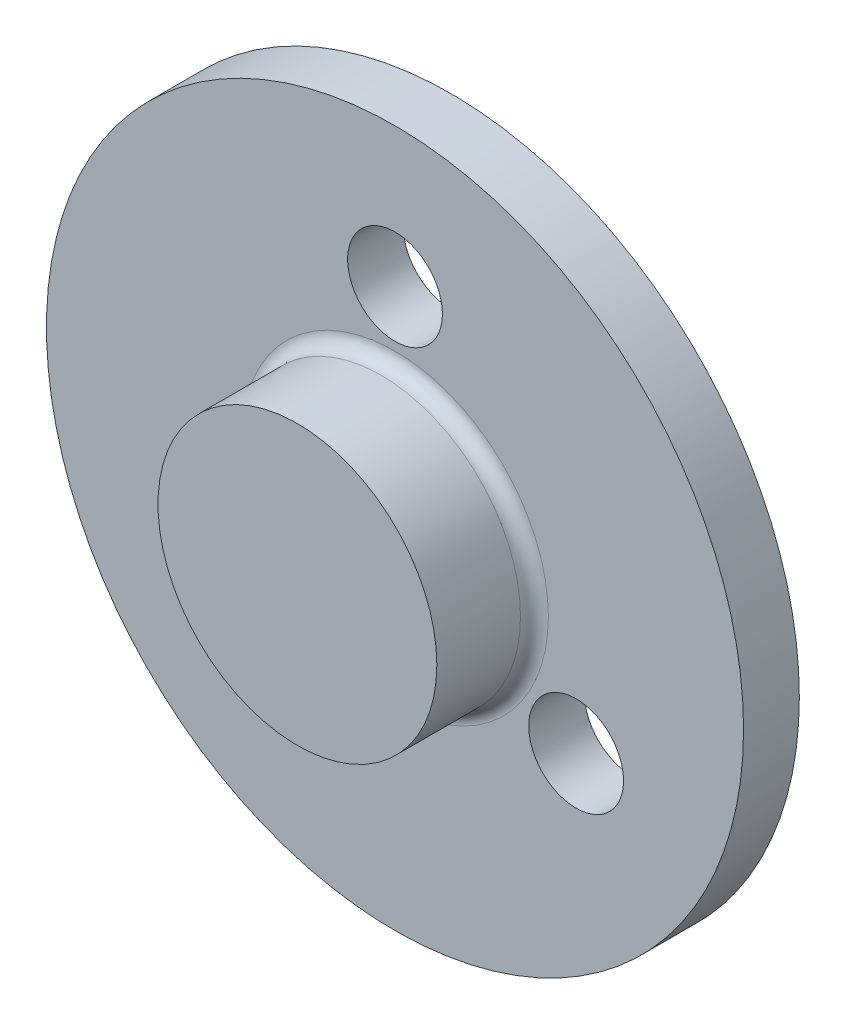
ISO-10303-21;
HEADER;
FILE_DESCRIPTION(('STEP AP214'),'2;1');
FILE_NAME('part.step','',(''),(''),'','','');
FILE_SCHEMA(('AUTOMOTIVE_DESIGN { 1 0 10303 214 1 1 1 1 }'));
ENDSEC;
DATA;
#1=APPLICATION_CONTEXT('core data for automotive mechanical design processes');
#2=APPLICATION_PROTOCOL_DEFINITION('international standard','automotive_design',2000,#1);
#3=PRODUCT_CONTEXT('',#1,'mechanical');
#4=PRODUCT('Part','Part','',(#3));
#5=PRODUCT_RELATED_PRODUCT_CATEGORY('part','',(#4));
#6=PRODUCT_DEFINITION_FORMATION('','',#4);
#7=PRODUCT_DEFINITION_CONTEXT('part definition',#1,'design');
#8=PRODUCT_DEFINITION('design','',#6,#7);
#9=PRODUCT_DEFINITION_SHAPE('','',#8);
#10=(LENGTH_UNIT() NAMED_UNIT(*) SI_UNIT(.MILLI.,.METRE.));
#11=(NAMED_UNIT(*) PLANE_ANGLE_UNIT() SI_UNIT($,.RADIAN.));
#12=(NAMED_UNIT(*) SI_UNIT($,.STERADIAN.) SOLID_ANGLE_UNIT());
#13=UNCERTAINTY_MEASURE_WITH_UNIT(LENGTH_MEASURE(1.E-05),#10,'distance_accuracy_value','');
#14=(GEOMETRIC_REPRESENTATION_CONTEXT(3) GLOBAL_UNCERTAINTY_ASSIGNED_CONTEXT((#13)) GLOBAL_UNIT_ASSIGNED_CONTEXT((#10,
#11,#12)) REPRESENTATION_CONTEXT('',''));
#15=CARTESIAN_POINT('',(0.,0.,0.));
#16=DIRECTION('',(0.,0.,1.));
#17=DIRECTION('',(1.,0.,0.));
#18=AXIS2_PLACEMENT_3D('',#15,#16,#17);
#19=CARTESIAN_POINT('',(0.,0.,-4.));
#20=DIRECTION('',(0.,0.,1.));
#21=DIRECTION('',(1.,0.,0.));
#22=AXIS2_PLACEMENT_3D('',#19,#20,#21);
#23=CYLINDRICAL_SURFACE('',#22,25.);
#24=CARTESIAN_POINT('',(0.,0.,-4.));
#25=DIRECTION('',(0.,0.,1.));
#26=DIRECTION('',(1.,0.,0.));
#27=AXIS2_PLACEMENT_3D('',#24,#25,#26);
#28=CIRCLE('',#27,25.);
#29=CARTESIAN_POINT('',(25.,0.,-4.));
#30=VERTEX_POINT('',#29);
#31=EDGE_CURVE('E56',#30,#30,#28,.T.);
#32=ORIENTED_EDGE('',*,*,#31,.T.);
#33=EDGE_LOOP('',(#32));
#34=FACE_BOUND('',#33,.T.);
#35=CARTESIAN_POINT('',(0.,0.,0.));
#36=DIRECTION('',(0.,0.,1.));
#37=DIRECTION('',(1.,0.,0.));
#38=AXIS2_PLACEMENT_3D('',#35,#36,#37);
#39=CIRCLE('',#38,25.);
#40=CARTESIAN_POINT('',(25.,0.,0.));
#41=VERTEX_POINT('',#40);
#42=EDGE_CURVE('E61',#41,#41,#39,.T.);
#43=ORIENTED_EDGE('',*,*,#42,.F.);
#44=EDGE_LOOP('',(#43));
#45=FACE_BOUND('',#44,.T.);
#46=ADVANCED_FACE('F43',(#34,#45),#23,.T.);
#47=CARTESIAN_POINT('',(0.,0.,-4.));
#48=DIRECTION('',(0.,0.,1.));
#49=DIRECTION('',(1.,0.,0.));
#50=AXIS2_PLACEMENT_3D('',#47,#48,#49);
#51=PLANE('',#50);
#52=CARTESIAN_POINT('',(0.,15.,-4.));
#53=DIRECTION('',(0.,0.,1.));
#54=DIRECTION('',(1.,0.,0.));
#55=AXIS2_PLACEMENT_3D('',#52,#53,#54);
#56=CIRCLE('',#55,3.4);
#57=CARTESIAN_POINT('',(3.4,15.,-4.));
#58=VERTEX_POINT('',#57);
#59=EDGE_CURVE('E95',#58,#58,#56,.T.);
#60=ORIENTED_EDGE('',*,*,#59,.T.);
#61=EDGE_LOOP('',(#60));
#62=FACE_BOUND('',#61,.T.);
#63=CARTESIAN_POINT('',(12.9903810567665,-7.50000000000006,-4.));
#64=DIRECTION('',(0.,0.,1.));
#65=DIRECTION('',(1.,0.,0.));
#66=AXIS2_PLACEMENT_3D('',#63,#64,#65);
#67=CIRCLE('',#66,3.4);
#68=CARTESIAN_POINT('',(16.3903810567665,-7.50000000000006,-4.));
#69=VERTEX_POINT('',#68);
#70=EDGE_CURVE('E87',#69,#69,#67,.T.);
#71=ORIENTED_EDGE('',*,*,#70,.T.);
#72=EDGE_LOOP('',(#71));
#73=FACE_BOUND('',#72,.T.);
#74=CARTESIAN_POINT('',(-12.9903810567667,-7.49999999999988,-4.));
#75=DIRECTION('',(0.,0.,1.));
#76=DIRECTION('',(1.,0.,0.));
#77=AXIS2_PLACEMENT_3D('',#74,#75,#76);
#78=CIRCLE('',#77,3.4);
#79=CARTESIAN_POINT('',(-9.59038105676665,-7.49999999999988,-4.));
#80=VERTEX_POINT('',#79);
#81=EDGE_CURVE('E76',#80,#80,#78,.T.);
#82=ORIENTED_EDGE('',*,*,#81,.T.);
#83=EDGE_LOOP('',(#82));
#84=FACE_BOUND('',#83,.T.);
#85=CARTESIAN_POINT('',(0.,0.,-4.));
#86=DIRECTION('',(0.,0.,-1.));
#87=DIRECTION('',(-1.,0.,0.));
#88=AXIS2_PLACEMENT_3D('',#85,#86,#87);
#89=CIRCLE('',#88,7.5);
#90=CARTESIAN_POINT('',(-7.5,0.,-4.));
#91=VERTEX_POINT('',#90);
#92=EDGE_CURVE('E72',#91,#91,#89,.T.);
#93=ORIENTED_EDGE('',*,*,#92,.F.);
#94=EDGE_LOOP('',(#93));
#95=FACE_BOUND('',#94,.T.);
#96=ORIENTED_EDGE('',*,*,#31,.F.);
#97=EDGE_LOOP('',(#96));
#98=FACE_BOUND('',#97,.T.);
#99=ADVANCED_FACE('F110',(#62,#73,#84,#95,#98),#51,.F.);
#100=CARTESIAN_POINT('',(0.,0.,0.));
#101=DIRECTION('',(0.,0.,1.));
#102=DIRECTION('',(1.,0.,0.));
#103=AXIS2_PLACEMENT_3D('',#100,#101,#102);
#104=PLANE('',#103);
#105=CARTESIAN_POINT('',(0.,15.,0.));
#106=DIRECTION('',(0.,0.,1.));
#107=DIRECTION('',(1.,0.,0.));
#108=AXIS2_PLACEMENT_3D('',#105,#106,#107);
#109=CIRCLE('',#108,3.4);
#110=CARTESIAN_POINT('',(3.4,15.,0.));
#111=VERTEX_POINT('',#110);
#112=EDGE_CURVE('E99',#111,#111,#109,.T.);
#113=ORIENTED_EDGE('',*,*,#112,.F.);
#114=EDGE_LOOP('',(#113));
#115=FACE_BOUND('',#114,.T.);
#116=CARTESIAN_POINT('',(12.9903810567665,-7.50000000000006,0.));
#117=DIRECTION('',(0.,0.,1.));
#118=DIRECTION('',(1.,0.,0.));
#119=AXIS2_PLACEMENT_3D('',#116,#117,#118);
#120=CIRCLE('',#119,3.4);
#121=CARTESIAN_POINT('',(16.3903810567665,-7.50000000000006,0.));
#122=VERTEX_POINT('',#121);
#123=EDGE_CURVE('E91',#122,#122,#120,.T.);
#124=ORIENTED_EDGE('',*,*,#123,.F.);
#125=EDGE_LOOP('',(#124));
#126=FACE_BOUND('',#125,.T.);
#127=CARTESIAN_POINT('',(-12.9903810567667,-7.49999999999988,0.));
#128=DIRECTION('',(0.,0.,1.));
#129=DIRECTION('',(1.,0.,0.));
#130=AXIS2_PLACEMENT_3D('',#127,#128,#129);
#131=CIRCLE('',#130,3.4);
#132=CARTESIAN_POINT('',(-9.59038105676665,-7.49999999999988,0.));
#133=VERTEX_POINT('',#132);
#134=EDGE_CURVE('E83',#133,#133,#131,.T.);
#135=ORIENTED_EDGE('',*,*,#134,.F.);
#136=EDGE_LOOP('',(#135));
#137=FACE_BOUND('',#136,.T.);
#138=CARTESIAN_POINT('',(0.,0.,0.));
#139=DIRECTION('',(0.,0.,1.));
#140=DIRECTION('',(1.,0.,0.));
#141=AXIS2_PLACEMENT_3D('',#138,#139,#140);
#142=CIRCLE('',#141,11.);
#143=CARTESIAN_POINT('',(11.,0.,0.));
#144=VERTEX_POINT('',#143);
#145=EDGE_CURVE('E10',#144,#144,#142,.F.);
#146=ORIENTED_EDGE('',*,*,#145,.T.);
#147=EDGE_LOOP('',(#146));
#148=FACE_BOUND('',#147,.T.);
#149=ORIENTED_EDGE('',*,*,#42,.T.);
#150=EDGE_LOOP('',(#149));
#151=FACE_BOUND('',#150,.T.);
#152=ADVANCED_FACE('F106',(#115,#126,#137,#148,#151),#104,.T.);
#153=CARTESIAN_POINT('',(0.,0.,7.));
#154=DIRECTION('',(0.,0.,-1.));
#155=DIRECTION('',(-1.,0.,0.));
#156=AXIS2_PLACEMENT_3D('',#153,#154,#155);
#157=CYLINDRICAL_SURFACE('',#156,10.);
#158=CARTESIAN_POINT('',(0.,0.,1.));
#159=DIRECTION('',(0.,0.,1.));
#160=DIRECTION('',(1.,0.,0.));
#161=AXIS2_PLACEMENT_3D('',#158,#159,#160);
#162=CIRCLE('',#161,10.);
#163=CARTESIAN_POINT('',(10.,0.,1.));
#164=VERTEX_POINT('',#163);
#165=EDGE_CURVE('E51',#164,#164,#162,.T.);
#166=ORIENTED_EDGE('',*,*,#165,.T.);
#167=EDGE_LOOP('',(#166));
#168=FACE_BOUND('',#167,.T.);
#169=CARTESIAN_POINT('',(0.,0.,7.));
#170=DIRECTION('',(0.,0.,1.));
#171=DIRECTION('',(1.,0.,0.));
#172=AXIS2_PLACEMENT_3D('',#169,#170,#171);
#173=CIRCLE('',#172,10.);
#174=CARTESIAN_POINT('',(10.,0.,7.));
#175=VERTEX_POINT('',#174);
#176=EDGE_CURVE('E66',#175,#175,#173,.T.);
#177=ORIENTED_EDGE('',*,*,#176,.F.);
#178=EDGE_LOOP('',(#177));
#179=FACE_BOUND('',#178,.T.);
#180=ADVANCED_FACE('F109',(#168,#179),#157,.T.);
#181=CARTESIAN_POINT('',(0.,0.,7.));
#182=DIRECTION('',(0.,0.,1.));
#183=DIRECTION('',(1.,0.,0.));
#184=AXIS2_PLACEMENT_3D('',#181,#182,#183);
#185=PLANE('',#184);
#186=ORIENTED_EDGE('',*,*,#176,.T.);
#187=EDGE_LOOP('',(#186));
#188=FACE_BOUND('',#187,.T.);
#189=ADVANCED_FACE('F129',(#188),#185,.T.);
#190=CARTESIAN_POINT('',(0.,0.,1.));
#191=DIRECTION('',(0.,0.,1.));
#192=DIRECTION('',(1.,0.,0.));
#193=AXIS2_PLACEMENT_3D('',#190,#191,#192);
#194=TOROIDAL_SURFACE('',#193,11.,1.);
#195=ORIENTED_EDGE('',*,*,#145,.F.);
#196=EDGE_LOOP('',(#195));
#197=FACE_BOUND('',#196,.T.);
#198=ORIENTED_EDGE('',*,*,#165,.F.);
#199=EDGE_LOOP('',(#198));
#200=FACE_BOUND('',#199,.T.);
#201=ADVANCED_FACE('F45',(#197,#200),#194,.F.);
#202=CARTESIAN_POINT('',(0.,0.,1.));
#203=DIRECTION('',(0.,0.,-1.));
#204=DIRECTION('',(-1.,0.,0.));
#205=AXIS2_PLACEMENT_3D('',#202,#203,#204);
#206=CYLINDRICAL_SURFACE('',#205,7.5);
#207=CARTESIAN_POINT('',(0.,0.,1.));
#208=DIRECTION('',(0.,0.,-1.));
#209=DIRECTION('',(-1.,0.,0.));
#210=AXIS2_PLACEMENT_3D('',#207,#208,#209);
#211=CIRCLE('',#210,7.5);
#212=CARTESIAN_POINT('',(-7.5,0.,1.));
#213=VERTEX_POINT('',#212);
#214=EDGE_CURVE('E71',#213,#213,#211,.T.);
#215=ORIENTED_EDGE('',*,*,#214,.F.);
#216=EDGE_LOOP('',(#215));
#217=FACE_BOUND('',#216,.T.);
#218=ORIENTED_EDGE('',*,*,#92,.T.);
#219=EDGE_LOOP('',(#218));
#220=FACE_BOUND('',#219,.T.);
#221=ADVANCED_FACE('F132',(#217,#220),#206,.F.);
#222=CARTESIAN_POINT('',(0.,0.,1.));
#223=DIRECTION('',(0.,0.,-1.));
#224=DIRECTION('',(-1.,0.,0.));
#225=AXIS2_PLACEMENT_3D('',#222,#223,#224);
#226=PLANE('',#225);
#227=ORIENTED_EDGE('',*,*,#214,.T.);
#228=EDGE_LOOP('',(#227));
#229=FACE_BOUND('',#228,.T.);
#230=ADVANCED_FACE('F135',(#229),#226,.T.);
#231=CARTESIAN_POINT('',(-12.9903810567667,-7.49999999999988,0.));
#232=DIRECTION('',(0.,0.,1.));
#233=DIRECTION('',(1.,0.,0.));
#234=AXIS2_PLACEMENT_3D('',#231,#232,#233);
#235=CYLINDRICAL_SURFACE('',#234,3.4);
#236=ORIENTED_EDGE('',*,*,#81,.F.);
#237=EDGE_LOOP('',(#236));
#238=FACE_BOUND('',#237,.T.);
#239=ORIENTED_EDGE('',*,*,#134,.T.);
#240=EDGE_LOOP('',(#239));
#241=FACE_BOUND('',#240,.T.);
#242=ADVANCED_FACE('F139',(#238,#241),#235,.F.);
#243=CARTESIAN_POINT('',(12.9903810567665,-7.50000000000006,0.));
#244=DIRECTION('',(0.,0.,1.));
#245=DIRECTION('',(1.,0.,0.));
#246=AXIS2_PLACEMENT_3D('',#243,#244,#245);
#247=CYLINDRICAL_SURFACE('',#246,3.4);
#248=ORIENTED_EDGE('',*,*,#70,.F.);
#249=EDGE_LOOP('',(#248));
#250=FACE_BOUND('',#249,.T.);
#251=ORIENTED_EDGE('',*,*,#123,.T.);
#252=EDGE_LOOP('',(#251));
#253=FACE_BOUND('',#252,.T.);
#254=ADVANCED_FACE('F143',(#250,#253),#247,.F.);
#255=CARTESIAN_POINT('',(0.,15.,0.));
#256=DIRECTION('',(0.,0.,1.));
#257=DIRECTION('',(1.,0.,0.));
#258=AXIS2_PLACEMENT_3D('',#255,#256,#257);
#259=CYLINDRICAL_SURFACE('',#258,3.4);
#260=ORIENTED_EDGE('',*,*,#59,.F.);
#261=EDGE_LOOP('',(#260));
#262=FACE_BOUND('',#261,.T.);
#263=ORIENTED_EDGE('',*,*,#112,.T.);
#264=EDGE_LOOP('',(#263));
#265=FACE_BOUND('',#264,.T.);
#266=ADVANCED_FACE('F104',(#262,#265),#259,.F.);
#267=CLOSED_SHELL('',(#46,#99,#152,#180,#189,#201,#221,#230,#242,#254,#266));
#268=MANIFOLD_SOLID_BREP('B2',#267);
#269=ADVANCED_BREP_SHAPE_REPRESENTATION('',(#18,#268),#14);
#270=SHAPE_DEFINITION_REPRESENTATION(#9,#269);
ENDSEC;
END-ISO-10303-21;
